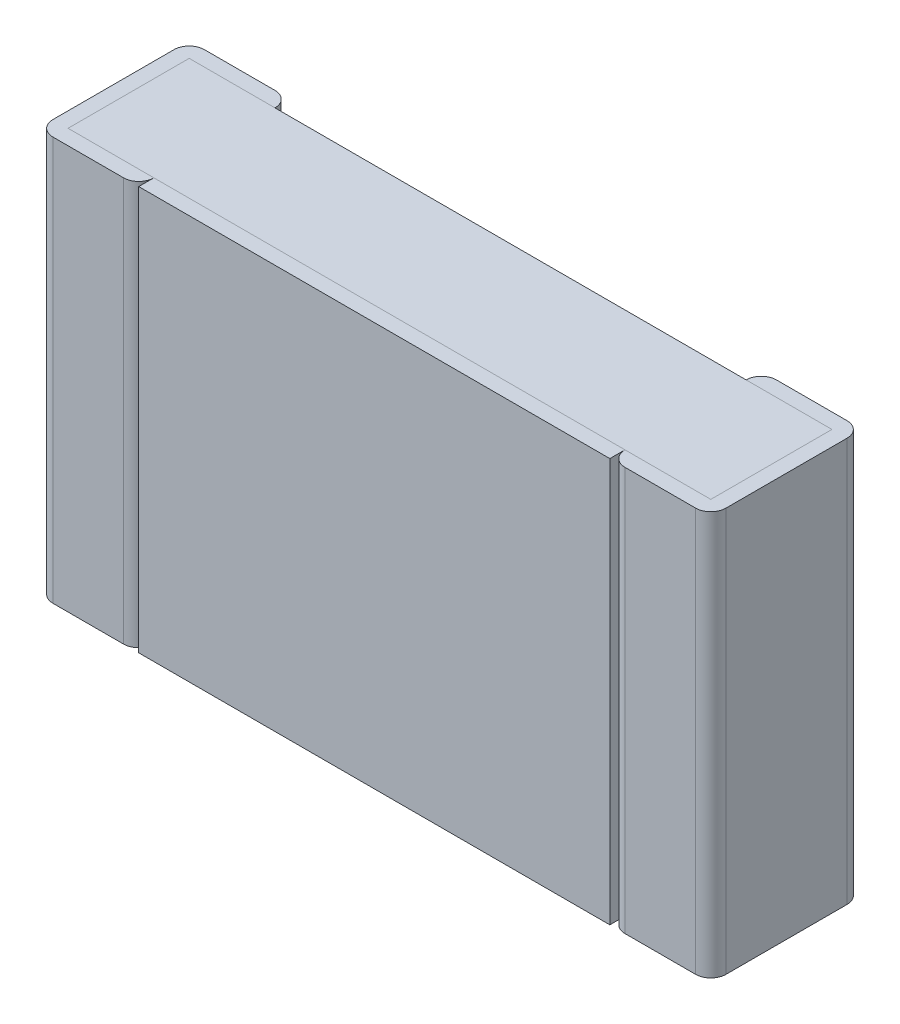
ISO-10303-21;
HEADER;
FILE_DESCRIPTION(('STEP AP214'),'2;1');
FILE_NAME('part.step','',(''),(''),'','','');
FILE_SCHEMA(('AUTOMOTIVE_DESIGN { 1 0 10303 214 1 1 1 1 }'));
ENDSEC;
DATA;
#1=APPLICATION_CONTEXT('core data for automotive mechanical design processes');
#2=APPLICATION_PROTOCOL_DEFINITION('international standard','automotive_design',2000,#1);
#3=PRODUCT_CONTEXT('',#1,'mechanical');
#4=PRODUCT('Part','Part','',(#3));
#5=PRODUCT_RELATED_PRODUCT_CATEGORY('part','',(#4));
#6=PRODUCT_DEFINITION_FORMATION('','',#4);
#7=PRODUCT_DEFINITION_CONTEXT('part definition',#1,'design');
#8=PRODUCT_DEFINITION('design','',#6,#7);
#9=PRODUCT_DEFINITION_SHAPE('','',#8);
#10=(LENGTH_UNIT() NAMED_UNIT(*) SI_UNIT(.MILLI.,.METRE.));
#11=(NAMED_UNIT(*) PLANE_ANGLE_UNIT() SI_UNIT($,.RADIAN.));
#12=(NAMED_UNIT(*) SI_UNIT($,.STERADIAN.) SOLID_ANGLE_UNIT());
#13=UNCERTAINTY_MEASURE_WITH_UNIT(LENGTH_MEASURE(1.E-05),#10,'distance_accuracy_value','');
#14=(GEOMETRIC_REPRESENTATION_CONTEXT(3) GLOBAL_UNCERTAINTY_ASSIGNED_CONTEXT((#13)) GLOBAL_UNIT_ASSIGNED_CONTEXT((#10,
#11,#12)) REPRESENTATION_CONTEXT('',''));
#15=CARTESIAN_POINT('',(0.,0.,0.));
#16=DIRECTION('',(0.,0.,1.));
#17=DIRECTION('',(1.,0.,0.));
#18=AXIS2_PLACEMENT_3D('',#15,#16,#17);
#19=CARTESIAN_POINT('',(-1.,-0.6,0.));
#20=DIRECTION('',(1.,0.,0.));
#21=DIRECTION('',(0.,1.,0.));
#22=AXIS2_PLACEMENT_3D('',#19,#20,#21);
#23=PLANE('',#22);
#24=DIRECTION('',(0.,1.,0.));
#25=VECTOR('',#24,1.);
#26=CARTESIAN_POINT('',(-1.,-0.6,0.405));
#27=LINE('',#26,#25);
#28=CARTESIAN_POINT('',(-1.,-0.6,0.405));
#29=VERTEX_POINT('',#28);
#30=CARTESIAN_POINT('',(-1.,0.6,0.405));
#31=VERTEX_POINT('',#30);
#32=EDGE_CURVE('E11',#29,#31,#27,.T.);
#33=ORIENTED_EDGE('',*,*,#32,.T.);
#34=DIRECTION('',(0.,0.,1.));
#35=VECTOR('',#34,1.);
#36=CARTESIAN_POINT('',(-1.,0.6,0.));
#37=LINE('',#36,#35);
#38=CARTESIAN_POINT('',(-1.,0.6,0.045));
#39=VERTEX_POINT('',#38);
#40=EDGE_CURVE('E41',#39,#31,#37,.T.);
#41=ORIENTED_EDGE('',*,*,#40,.F.);
#42=DIRECTION('',(0.,1.,0.));
#43=VECTOR('',#42,1.);
#44=CARTESIAN_POINT('',(-1.,-0.6,0.045));
#45=LINE('',#44,#43);
#46=CARTESIAN_POINT('',(-1.,-0.6,0.045));
#47=VERTEX_POINT('',#46);
#48=EDGE_CURVE('E398',#47,#39,#45,.T.);
#49=ORIENTED_EDGE('',*,*,#48,.F.);
#50=DIRECTION('',(0.,0.,1.));
#51=VECTOR('',#50,1.);
#52=CARTESIAN_POINT('',(-1.,-0.6,0.));
#53=LINE('',#52,#51);
#54=EDGE_CURVE('E27',#47,#29,#53,.T.);
#55=ORIENTED_EDGE('',*,*,#54,.T.);
#56=EDGE_LOOP('',(#33,#41,#49,#55));
#57=FACE_BOUND('',#56,.T.);
#58=ADVANCED_FACE('F16',(#57),#23,.F.);
#59=CARTESIAN_POINT('',(-1.,-0.6,0.));
#60=DIRECTION('',(0.,1.,0.));
#61=DIRECTION('',(1.,0.,0.));
#62=AXIS2_PLACEMENT_3D('',#59,#60,#61);
#63=PLANE('',#62);
#64=CARTESIAN_POINT('',(-0.745,-0.6,0.045));
#65=DIRECTION('',(0.,1.,0.));
#66=DIRECTION('',(0.,0.,1.));
#67=AXIS2_PLACEMENT_3D('',#64,#65,#66);
#68=CIRCLE('',#67,0.045);
#69=CARTESIAN_POINT('',(-0.7,-0.6,0.045));
#70=VERTEX_POINT('',#69);
#71=CARTESIAN_POINT('',(-0.745,-0.6,0.));
#72=VERTEX_POINT('',#71);
#73=EDGE_CURVE('E387',#70,#72,#68,.T.);
#74=ORIENTED_EDGE('',*,*,#73,.F.);
#75=DIRECTION('',(1.,0.,0.));
#76=VECTOR('',#75,1.);
#77=CARTESIAN_POINT('',(-0.955,-0.6,0.045));
#78=LINE('',#77,#76);
#79=CARTESIAN_POINT('',(-0.955,-0.6,0.045));
#80=VERTEX_POINT('',#79);
#81=EDGE_CURVE('E428',#80,#70,#78,.T.);
#82=ORIENTED_EDGE('',*,*,#81,.F.);
#83=DIRECTION('',(0.,0.,1.));
#84=VECTOR('',#83,1.);
#85=CARTESIAN_POINT('',(-0.955,-0.6,0.045));
#86=LINE('',#85,#84);
#87=CARTESIAN_POINT('',(-0.955,-0.6,0.405));
#88=VERTEX_POINT('',#87);
#89=EDGE_CURVE('E230',#80,#88,#86,.T.);
#90=ORIENTED_EDGE('',*,*,#89,.T.);
#91=DIRECTION('',(1.,0.,0.));
#92=VECTOR('',#91,1.);
#93=CARTESIAN_POINT('',(-0.955,-0.6,0.405));
#94=LINE('',#93,#92);
#95=CARTESIAN_POINT('',(-0.7,-0.6,0.405));
#96=VERTEX_POINT('',#95);
#97=EDGE_CURVE('E241',#88,#96,#94,.T.);
#98=ORIENTED_EDGE('',*,*,#97,.T.);
#99=CARTESIAN_POINT('',(-0.745,-0.6,0.405));
#100=DIRECTION('',(0.,-1.,0.));
#101=DIRECTION('',(0.,0.,1.));
#102=AXIS2_PLACEMENT_3D('',#99,#100,#101);
#103=CIRCLE('',#102,0.045);
#104=CARTESIAN_POINT('',(-0.745,-0.6,0.45));
#105=VERTEX_POINT('',#104);
#106=EDGE_CURVE('E270',#96,#105,#103,.T.);
#107=ORIENTED_EDGE('',*,*,#106,.T.);
#108=DIRECTION('',(1.,0.,0.));
#109=VECTOR('',#108,1.);
#110=CARTESIAN_POINT('',(-1.,-0.6,0.45));
#111=LINE('',#110,#109);
#112=CARTESIAN_POINT('',(-0.955,-0.6,0.45));
#113=VERTEX_POINT('',#112);
#114=EDGE_CURVE('E425',#113,#105,#111,.T.);
#115=ORIENTED_EDGE('',*,*,#114,.F.);
#116=CARTESIAN_POINT('',(-0.955,-0.6,0.405));
#117=DIRECTION('',(0.,1.,0.));
#118=DIRECTION('',(0.,0.,1.));
#119=AXIS2_PLACEMENT_3D('',#116,#117,#118);
#120=CIRCLE('',#119,0.045);
#121=EDGE_CURVE('E405',#29,#113,#120,.T.);
#122=ORIENTED_EDGE('',*,*,#121,.F.);
#123=ORIENTED_EDGE('',*,*,#54,.F.);
#124=CARTESIAN_POINT('',(-0.955,-0.6,0.045));
#125=DIRECTION('',(0.,-1.,0.));
#126=DIRECTION('',(0.,0.,1.));
#127=AXIS2_PLACEMENT_3D('',#124,#125,#126);
#128=CIRCLE('',#127,0.045);
#129=CARTESIAN_POINT('',(-0.955,-0.6,0.));
#130=VERTEX_POINT('',#129);
#131=EDGE_CURVE('E274',#47,#130,#128,.T.);
#132=ORIENTED_EDGE('',*,*,#131,.T.);
#133=DIRECTION('',(1.,0.,0.));
#134=VECTOR('',#133,1.);
#135=CARTESIAN_POINT('',(-1.,-0.6,0.));
#136=LINE('',#135,#134);
#137=EDGE_CURVE('E332',#130,#72,#136,.T.);
#138=ORIENTED_EDGE('',*,*,#137,.T.);
#139=EDGE_LOOP('',(#74,#82,#90,#98,#107,#115,#122,#123,#132,#138));
#140=FACE_BOUND('',#139,.T.);
#141=ADVANCED_FACE('F277',(#140),#63,.F.);
#142=CARTESIAN_POINT('',(-0.955,-0.6,0.045));
#143=DIRECTION('',(0.,1.,0.));
#144=DIRECTION('',(-1.,0.,0.));
#145=AXIS2_PLACEMENT_3D('',#142,#143,#144);
#146=CYLINDRICAL_SURFACE('',#145,0.045);
#147=ORIENTED_EDGE('',*,*,#48,.T.);
#148=CARTESIAN_POINT('',(-0.955,0.6,0.045));
#149=DIRECTION('',(0.,-1.,0.));
#150=DIRECTION('',(0.,0.,1.));
#151=AXIS2_PLACEMENT_3D('',#148,#149,#150);
#152=CIRCLE('',#151,0.045);
#153=CARTESIAN_POINT('',(-0.955,0.6,0.));
#154=VERTEX_POINT('',#153);
#155=EDGE_CURVE('E401',#39,#154,#152,.T.);
#156=ORIENTED_EDGE('',*,*,#155,.T.);
#157=DIRECTION('',(0.,1.,0.));
#158=VECTOR('',#157,1.);
#159=CARTESIAN_POINT('',(-0.955,-0.6,0.));
#160=LINE('',#159,#158);
#161=EDGE_CURVE('E303',#130,#154,#160,.T.);
#162=ORIENTED_EDGE('',*,*,#161,.F.);
#163=ORIENTED_EDGE('',*,*,#131,.F.);
#164=EDGE_LOOP('',(#147,#156,#162,#163));
#165=FACE_BOUND('',#164,.T.);
#166=ADVANCED_FACE('F707',(#165),#146,.T.);
#167=CARTESIAN_POINT('',(-0.955,-0.6,0.405));
#168=DIRECTION('',(0.,1.,0.));
#169=DIRECTION('',(-1.,0.,0.));
#170=AXIS2_PLACEMENT_3D('',#167,#168,#169);
#171=CYLINDRICAL_SURFACE('',#170,0.045);
#172=ORIENTED_EDGE('',*,*,#121,.T.);
#173=DIRECTION('',(0.,1.,0.));
#174=VECTOR('',#173,1.);
#175=CARTESIAN_POINT('',(-0.955,-0.6,0.45));
#176=LINE('',#175,#174);
#177=CARTESIAN_POINT('',(-0.955,0.6,0.45));
#178=VERTEX_POINT('',#177);
#179=EDGE_CURVE('E402',#113,#178,#176,.T.);
#180=ORIENTED_EDGE('',*,*,#179,.T.);
#181=CARTESIAN_POINT('',(-0.955,0.6,0.405));
#182=DIRECTION('',(0.,1.,0.));
#183=DIRECTION('',(0.,0.,1.));
#184=AXIS2_PLACEMENT_3D('',#181,#182,#183);
#185=CIRCLE('',#184,0.045);
#186=EDGE_CURVE('E328',#31,#178,#185,.T.);
#187=ORIENTED_EDGE('',*,*,#186,.F.);
#188=ORIENTED_EDGE('',*,*,#32,.F.);
#189=EDGE_LOOP('',(#172,#180,#187,#188));
#190=FACE_BOUND('',#189,.T.);
#191=ADVANCED_FACE('F697',(#190),#171,.T.);
#192=CARTESIAN_POINT('',(-1.,0.6,0.));
#193=DIRECTION('',(0.,1.,0.));
#194=DIRECTION('',(1.,0.,0.));
#195=AXIS2_PLACEMENT_3D('',#192,#193,#194);
#196=PLANE('',#195);
#197=DIRECTION('',(1.,0.,0.));
#198=VECTOR('',#197,1.);
#199=CARTESIAN_POINT('',(-1.,0.6,0.));
#200=LINE('',#199,#198);
#201=CARTESIAN_POINT('',(-0.745,0.6,0.));
#202=VERTEX_POINT('',#201);
#203=EDGE_CURVE('E384',#154,#202,#200,.T.);
#204=ORIENTED_EDGE('',*,*,#203,.F.);
#205=ORIENTED_EDGE('',*,*,#155,.F.);
#206=ORIENTED_EDGE('',*,*,#40,.T.);
#207=ORIENTED_EDGE('',*,*,#186,.T.);
#208=DIRECTION('',(1.,0.,0.));
#209=VECTOR('',#208,1.);
#210=CARTESIAN_POINT('',(-1.,0.6,0.45));
#211=LINE('',#210,#209);
#212=CARTESIAN_POINT('',(-0.745,0.6,0.45));
#213=VERTEX_POINT('',#212);
#214=EDGE_CURVE('E391',#178,#213,#211,.T.);
#215=ORIENTED_EDGE('',*,*,#214,.T.);
#216=CARTESIAN_POINT('',(-0.745,0.6,0.405));
#217=DIRECTION('',(0.,-1.,0.));
#218=DIRECTION('',(0.,0.,1.));
#219=AXIS2_PLACEMENT_3D('',#216,#217,#218);
#220=CIRCLE('',#219,0.045);
#221=CARTESIAN_POINT('',(-0.7,0.6,0.405));
#222=VERTEX_POINT('',#221);
#223=EDGE_CURVE('E266',#222,#213,#220,.T.);
#224=ORIENTED_EDGE('',*,*,#223,.F.);
#225=DIRECTION('',(1.,0.,0.));
#226=VECTOR('',#225,1.);
#227=CARTESIAN_POINT('',(-0.955,0.6,0.405));
#228=LINE('',#227,#226);
#229=CARTESIAN_POINT('',(-0.955,0.6,0.405));
#230=VERTEX_POINT('',#229);
#231=EDGE_CURVE('E351',#230,#222,#228,.T.);
#232=ORIENTED_EDGE('',*,*,#231,.F.);
#233=DIRECTION('',(0.,0.,1.));
#234=VECTOR('',#233,1.);
#235=CARTESIAN_POINT('',(-0.955,0.6,0.045));
#236=LINE('',#235,#234);
#237=CARTESIAN_POINT('',(-0.955,0.6,0.045));
#238=VERTEX_POINT('',#237);
#239=EDGE_CURVE('E347',#238,#230,#236,.T.);
#240=ORIENTED_EDGE('',*,*,#239,.F.);
#241=DIRECTION('',(1.,0.,0.));
#242=VECTOR('',#241,1.);
#243=CARTESIAN_POINT('',(-0.955,0.6,0.045));
#244=LINE('',#243,#242);
#245=CARTESIAN_POINT('',(-0.7,0.6,0.045));
#246=VERTEX_POINT('',#245);
#247=EDGE_CURVE('E302',#238,#246,#244,.T.);
#248=ORIENTED_EDGE('',*,*,#247,.T.);
#249=CARTESIAN_POINT('',(-0.745,0.6,0.045));
#250=DIRECTION('',(0.,1.,0.));
#251=DIRECTION('',(0.,0.,1.));
#252=AXIS2_PLACEMENT_3D('',#249,#250,#251);
#253=CIRCLE('',#252,0.045);
#254=EDGE_CURVE('E299',#246,#202,#253,.T.);
#255=ORIENTED_EDGE('',*,*,#254,.T.);
#256=EDGE_LOOP('',(#204,#205,#206,#207,#215,#224,#232,#240,#248,#255));
#257=FACE_BOUND('',#256,.T.);
#258=ADVANCED_FACE('F684',(#257),#196,.T.);
#259=CARTESIAN_POINT('',(-1.,-0.6,0.));
#260=DIRECTION('',(0.,0.,1.));
#261=DIRECTION('',(1.,0.,0.));
#262=AXIS2_PLACEMENT_3D('',#259,#260,#261);
#263=PLANE('',#262);
#264=DIRECTION('',(0.,1.,0.));
#265=VECTOR('',#264,1.);
#266=CARTESIAN_POINT('',(-0.745,-0.6,0.));
#267=LINE('',#266,#265);
#268=EDGE_CURVE('E390',#72,#202,#267,.T.);
#269=ORIENTED_EDGE('',*,*,#268,.F.);
#270=ORIENTED_EDGE('',*,*,#137,.F.);
#271=ORIENTED_EDGE('',*,*,#161,.T.);
#272=ORIENTED_EDGE('',*,*,#203,.T.);
#273=EDGE_LOOP('',(#269,#270,#271,#272));
#274=FACE_BOUND('',#273,.T.);
#275=ADVANCED_FACE('F671',(#274),#263,.F.);
#276=CARTESIAN_POINT('',(-0.745,-0.6,0.045));
#277=DIRECTION('',(0.,1.,0.));
#278=DIRECTION('',(1.,0.,0.));
#279=AXIS2_PLACEMENT_3D('',#276,#277,#278);
#280=CYLINDRICAL_SURFACE('',#279,0.045);
#281=ORIENTED_EDGE('',*,*,#73,.T.);
#282=ORIENTED_EDGE('',*,*,#268,.T.);
#283=ORIENTED_EDGE('',*,*,#254,.F.);
#284=DIRECTION('',(0.,1.,0.));
#285=VECTOR('',#284,1.);
#286=CARTESIAN_POINT('',(-0.7,-0.6,0.045));
#287=LINE('',#286,#285);
#288=EDGE_CURVE('E451',#70,#246,#287,.T.);
#289=ORIENTED_EDGE('',*,*,#288,.F.);
#290=EDGE_LOOP('',(#281,#282,#283,#289));
#291=FACE_BOUND('',#290,.T.);
#292=ADVANCED_FACE('F572',(#291),#280,.T.);
#293=CARTESIAN_POINT('',(-0.955,-0.6,0.045));
#294=DIRECTION('',(0.,1.,0.));
#295=DIRECTION('',(1.,0.,0.));
#296=AXIS2_PLACEMENT_3D('',#293,#294,#295);
#297=PLANE('',#296);
#298=DIRECTION('',(1.,0.,0.));
#299=VECTOR('',#298,1.);
#300=CARTESIAN_POINT('',(-0.955,-0.6,0.045));
#301=LINE('',#300,#299);
#302=CARTESIAN_POINT('',(0.7,-0.6,0.045));
#303=VERTEX_POINT('',#302);
#304=EDGE_CURVE('E375',#70,#303,#301,.T.);
#305=ORIENTED_EDGE('',*,*,#304,.T.);
#306=DIRECTION('',(1.,0.,0.));
#307=VECTOR('',#306,1.);
#308=CARTESIAN_POINT('',(-0.955,-0.6,0.045));
#309=LINE('',#308,#307);
#310=CARTESIAN_POINT('',(0.955,-0.6,0.045));
#311=VERTEX_POINT('',#310);
#312=EDGE_CURVE('E371',#303,#311,#309,.T.);
#313=ORIENTED_EDGE('',*,*,#312,.T.);
#314=DIRECTION('',(0.,0.,1.));
#315=VECTOR('',#314,1.);
#316=CARTESIAN_POINT('',(0.955,-0.6,0.045));
#317=LINE('',#316,#315);
#318=CARTESIAN_POINT('',(0.955,-0.6,0.405));
#319=VERTEX_POINT('',#318);
#320=EDGE_CURVE('E376',#311,#319,#317,.T.);
#321=ORIENTED_EDGE('',*,*,#320,.T.);
#322=DIRECTION('',(1.,0.,0.));
#323=VECTOR('',#322,1.);
#324=CARTESIAN_POINT('',(-0.955,-0.6,0.405));
#325=LINE('',#324,#323);
#326=CARTESIAN_POINT('',(0.7,-0.6,0.405));
#327=VERTEX_POINT('',#326);
#328=EDGE_CURVE('E243',#327,#319,#325,.T.);
#329=ORIENTED_EDGE('',*,*,#328,.F.);
#330=DIRECTION('',(1.,0.,0.));
#331=VECTOR('',#330,1.);
#332=CARTESIAN_POINT('',(-0.7,-0.6,0.405));
#333=LINE('',#332,#331);
#334=EDGE_CURVE('E237',#96,#327,#333,.T.);
#335=ORIENTED_EDGE('',*,*,#334,.F.);
#336=ORIENTED_EDGE('',*,*,#97,.F.);
#337=ORIENTED_EDGE('',*,*,#89,.F.);
#338=ORIENTED_EDGE('',*,*,#81,.T.);
#339=EDGE_LOOP('',(#305,#313,#321,#329,#335,#336,#337,#338));
#340=FACE_BOUND('',#339,.T.);
#341=ADVANCED_FACE('F240',(#340),#297,.F.);
#342=CARTESIAN_POINT('',(-1.,-0.6,0.45));
#343=DIRECTION('',(0.,0.,1.));
#344=DIRECTION('',(1.,0.,0.));
#345=AXIS2_PLACEMENT_3D('',#342,#343,#344);
#346=PLANE('',#345);
#347=ORIENTED_EDGE('',*,*,#214,.F.);
#348=ORIENTED_EDGE('',*,*,#179,.F.);
#349=ORIENTED_EDGE('',*,*,#114,.T.);
#350=DIRECTION('',(0.,1.,0.));
#351=VECTOR('',#350,1.);
#352=CARTESIAN_POINT('',(-0.745,-0.6,0.45));
#353=LINE('',#352,#351);
#354=EDGE_CURVE('E265',#105,#213,#353,.T.);
#355=ORIENTED_EDGE('',*,*,#354,.T.);
#356=EDGE_LOOP('',(#347,#348,#349,#355));
#357=FACE_BOUND('',#356,.T.);
#358=ADVANCED_FACE('F571',(#357),#346,.T.);
#359=CARTESIAN_POINT('',(-0.745,-0.6,0.405));
#360=DIRECTION('',(0.,1.,0.));
#361=DIRECTION('',(1.,0.,0.));
#362=AXIS2_PLACEMENT_3D('',#359,#360,#361);
#363=CYLINDRICAL_SURFACE('',#362,0.045);
#364=DIRECTION('',(0.,1.,0.));
#365=VECTOR('',#364,1.);
#366=CARTESIAN_POINT('',(-0.7,-0.6,0.405));
#367=LINE('',#366,#365);
#368=EDGE_CURVE('E256',#96,#222,#367,.T.);
#369=ORIENTED_EDGE('',*,*,#368,.T.);
#370=ORIENTED_EDGE('',*,*,#223,.T.);
#371=ORIENTED_EDGE('',*,*,#354,.F.);
#372=ORIENTED_EDGE('',*,*,#106,.F.);
#373=EDGE_LOOP('',(#369,#370,#371,#372));
#374=FACE_BOUND('',#373,.T.);
#375=ADVANCED_FACE('F271',(#374),#363,.T.);
#376=CARTESIAN_POINT('',(-0.955,0.6,0.045));
#377=DIRECTION('',(0.,1.,0.));
#378=DIRECTION('',(1.,0.,0.));
#379=AXIS2_PLACEMENT_3D('',#376,#377,#378);
#380=PLANE('',#379);
#381=ORIENTED_EDGE('',*,*,#247,.F.);
#382=ORIENTED_EDGE('',*,*,#239,.T.);
#383=ORIENTED_EDGE('',*,*,#231,.T.);
#384=DIRECTION('',(1.,0.,0.));
#385=VECTOR('',#384,1.);
#386=CARTESIAN_POINT('',(-0.7,0.6,0.405));
#387=LINE('',#386,#385);
#388=CARTESIAN_POINT('',(0.7,0.6,0.405));
#389=VERTEX_POINT('',#388);
#390=EDGE_CURVE('E336',#222,#389,#387,.T.);
#391=ORIENTED_EDGE('',*,*,#390,.T.);
#392=DIRECTION('',(1.,0.,0.));
#393=VECTOR('',#392,1.);
#394=CARTESIAN_POINT('',(-0.955,0.6,0.405));
#395=LINE('',#394,#393);
#396=CARTESIAN_POINT('',(0.955,0.6,0.405));
#397=VERTEX_POINT('',#396);
#398=EDGE_CURVE('E333',#389,#397,#395,.T.);
#399=ORIENTED_EDGE('',*,*,#398,.T.);
#400=DIRECTION('',(0.,0.,1.));
#401=VECTOR('',#400,1.);
#402=CARTESIAN_POINT('',(0.955,0.6,0.045));
#403=LINE('',#402,#401);
#404=CARTESIAN_POINT('',(0.955,0.6,0.045));
#405=VERTEX_POINT('',#404);
#406=EDGE_CURVE('E291',#405,#397,#403,.T.);
#407=ORIENTED_EDGE('',*,*,#406,.F.);
#408=DIRECTION('',(1.,0.,0.));
#409=VECTOR('',#408,1.);
#410=CARTESIAN_POINT('',(-0.955,0.6,0.045));
#411=LINE('',#410,#409);
#412=CARTESIAN_POINT('',(0.7,0.6,0.045));
#413=VERTEX_POINT('',#412);
#414=EDGE_CURVE('E283',#413,#405,#411,.T.);
#415=ORIENTED_EDGE('',*,*,#414,.F.);
#416=DIRECTION('',(1.,0.,0.));
#417=VECTOR('',#416,1.);
#418=CARTESIAN_POINT('',(-0.955,0.6,0.045));
#419=LINE('',#418,#417);
#420=EDGE_CURVE('E337',#246,#413,#419,.T.);
#421=ORIENTED_EDGE('',*,*,#420,.F.);
#422=EDGE_LOOP('',(#381,#382,#383,#391,#399,#407,#415,#421));
#423=FACE_BOUND('',#422,.T.);
#424=ADVANCED_FACE('F505',(#423),#380,.T.);
#425=CARTESIAN_POINT('',(-0.955,-0.6,0.045));
#426=DIRECTION('',(0.,0.,1.));
#427=DIRECTION('',(1.,0.,0.));
#428=AXIS2_PLACEMENT_3D('',#425,#426,#427);
#429=PLANE('',#428);
#430=ORIENTED_EDGE('',*,*,#420,.T.);
#431=DIRECTION('',(0.,1.,0.));
#432=VECTOR('',#431,1.);
#433=CARTESIAN_POINT('',(0.7,-0.6,0.045));
#434=LINE('',#433,#432);
#435=EDGE_CURVE('E343',#303,#413,#434,.T.);
#436=ORIENTED_EDGE('',*,*,#435,.F.);
#437=ORIENTED_EDGE('',*,*,#304,.F.);
#438=ORIENTED_EDGE('',*,*,#288,.T.);
#439=EDGE_LOOP('',(#430,#436,#437,#438));
#440=FACE_BOUND('',#439,.T.);
#441=ADVANCED_FACE('F560',(#440),#429,.F.);
#442=CARTESIAN_POINT('',(0.7,-0.6,0.));
#443=DIRECTION('',(0.,1.,0.));
#444=DIRECTION('',(1.,0.,0.));
#445=AXIS2_PLACEMENT_3D('',#442,#443,#444);
#446=PLANE('',#445);
#447=CARTESIAN_POINT('',(0.955,-0.6,0.045));
#448=DIRECTION('',(0.,1.,0.));
#449=DIRECTION('',(0.,0.,1.));
#450=AXIS2_PLACEMENT_3D('',#447,#448,#449);
#451=CIRCLE('',#450,0.045);
#452=CARTESIAN_POINT('',(1.,-0.6,0.045));
#453=VERTEX_POINT('',#452);
#454=CARTESIAN_POINT('',(0.955,-0.6,0.));
#455=VERTEX_POINT('',#454);
#456=EDGE_CURVE('E307',#453,#455,#451,.T.);
#457=ORIENTED_EDGE('',*,*,#456,.F.);
#458=DIRECTION('',(0.,0.,1.));
#459=VECTOR('',#458,1.);
#460=CARTESIAN_POINT('',(1.,-0.6,0.));
#461=LINE('',#460,#459);
#462=CARTESIAN_POINT('',(1.,-0.6,0.405));
#463=VERTEX_POINT('',#462);
#464=EDGE_CURVE('E443',#453,#463,#461,.T.);
#465=ORIENTED_EDGE('',*,*,#464,.T.);
#466=CARTESIAN_POINT('',(0.955,-0.6,0.405));
#467=DIRECTION('',(0.,-1.,0.));
#468=DIRECTION('',(0.,0.,1.));
#469=AXIS2_PLACEMENT_3D('',#466,#467,#468);
#470=CIRCLE('',#469,0.045);
#471=CARTESIAN_POINT('',(0.955,-0.6,0.45));
#472=VERTEX_POINT('',#471);
#473=EDGE_CURVE('E440',#463,#472,#470,.T.);
#474=ORIENTED_EDGE('',*,*,#473,.T.);
#475=DIRECTION('',(1.,0.,0.));
#476=VECTOR('',#475,1.);
#477=CARTESIAN_POINT('',(0.7,-0.6,0.45));
#478=LINE('',#477,#476);
#479=CARTESIAN_POINT('',(0.745,-0.6,0.45));
#480=VERTEX_POINT('',#479);
#481=EDGE_CURVE('E344',#480,#472,#478,.T.);
#482=ORIENTED_EDGE('',*,*,#481,.F.);
#483=CARTESIAN_POINT('',(0.745,-0.6,0.405));
#484=DIRECTION('',(0.,1.,0.));
#485=DIRECTION('',(0.,0.,1.));
#486=AXIS2_PLACEMENT_3D('',#483,#484,#485);
#487=CIRCLE('',#486,0.045);
#488=EDGE_CURVE('E189',#327,#480,#487,.T.);
#489=ORIENTED_EDGE('',*,*,#488,.F.);
#490=ORIENTED_EDGE('',*,*,#328,.T.);
#491=ORIENTED_EDGE('',*,*,#320,.F.);
#492=ORIENTED_EDGE('',*,*,#312,.F.);
#493=CARTESIAN_POINT('',(0.745,-0.6,0.045));
#494=DIRECTION('',(0.,-1.,0.));
#495=DIRECTION('',(0.,0.,1.));
#496=AXIS2_PLACEMENT_3D('',#493,#494,#495);
#497=CIRCLE('',#496,0.045);
#498=CARTESIAN_POINT('',(0.745,-0.6,0.));
#499=VERTEX_POINT('',#498);
#500=EDGE_CURVE('E359',#303,#499,#497,.T.);
#501=ORIENTED_EDGE('',*,*,#500,.T.);
#502=DIRECTION('',(1.,0.,0.));
#503=VECTOR('',#502,1.);
#504=CARTESIAN_POINT('',(0.7,-0.6,0.));
#505=LINE('',#504,#503);
#506=EDGE_CURVE('E180',#499,#455,#505,.T.);
#507=ORIENTED_EDGE('',*,*,#506,.T.);
#508=EDGE_LOOP('',(#457,#465,#474,#482,#489,#490,#491,#492,#501,#507));
#509=FACE_BOUND('',#508,.T.);
#510=ADVANCED_FACE('F592',(#509),#446,.F.);
#511=CARTESIAN_POINT('',(-0.7,-0.6,0.405));
#512=DIRECTION('',(0.,1.,0.));
#513=DIRECTION('',(1.,0.,0.));
#514=AXIS2_PLACEMENT_3D('',#511,#512,#513);
#515=PLANE('',#514);
#516=DIRECTION('',(0.,0.,1.));
#517=VECTOR('',#516,1.);
#518=CARTESIAN_POINT('',(0.7,-0.6,0.405));
#519=LINE('',#518,#517);
#520=CARTESIAN_POINT('',(0.7,-0.6,0.45));
#521=VERTEX_POINT('',#520);
#522=EDGE_CURVE('E249',#327,#521,#519,.T.);
#523=ORIENTED_EDGE('',*,*,#522,.T.);
#524=DIRECTION('',(1.,0.,0.));
#525=VECTOR('',#524,1.);
#526=CARTESIAN_POINT('',(-0.7,-0.6,0.45));
#527=LINE('',#526,#525);
#528=CARTESIAN_POINT('',(-0.7,-0.6,0.45));
#529=VERTEX_POINT('',#528);
#530=EDGE_CURVE('E281',#529,#521,#527,.T.);
#531=ORIENTED_EDGE('',*,*,#530,.F.);
#532=DIRECTION('',(0.,0.,1.));
#533=VECTOR('',#532,1.);
#534=CARTESIAN_POINT('',(-0.7,-0.6,0.405));
#535=LINE('',#534,#533);
#536=EDGE_CURVE('E260',#96,#529,#535,.T.);
#537=ORIENTED_EDGE('',*,*,#536,.F.);
#538=ORIENTED_EDGE('',*,*,#334,.T.);
#539=EDGE_LOOP('',(#523,#531,#537,#538));
#540=FACE_BOUND('',#539,.T.);
#541=ADVANCED_FACE('F280',(#540),#515,.F.);
#542=CARTESIAN_POINT('',(-0.7,-0.6,0.405));
#543=DIRECTION('',(1.,0.,0.));
#544=DIRECTION('',(0.,1.,0.));
#545=AXIS2_PLACEMENT_3D('',#542,#543,#544);
#546=PLANE('',#545);
#547=DIRECTION('',(0.,1.,0.));
#548=VECTOR('',#547,1.);
#549=CARTESIAN_POINT('',(-0.7,-0.6,0.45));
#550=LINE('',#549,#548);
#551=CARTESIAN_POINT('',(-0.7,0.6,0.45));
#552=VERTEX_POINT('',#551);
#553=EDGE_CURVE('E250',#529,#552,#550,.T.);
#554=ORIENTED_EDGE('',*,*,#553,.T.);
#555=DIRECTION('',(0.,0.,1.));
#556=VECTOR('',#555,1.);
#557=CARTESIAN_POINT('',(-0.7,0.6,0.405));
#558=LINE('',#557,#556);
#559=EDGE_CURVE('E262',#222,#552,#558,.T.);
#560=ORIENTED_EDGE('',*,*,#559,.F.);
#561=ORIENTED_EDGE('',*,*,#368,.F.);
#562=ORIENTED_EDGE('',*,*,#536,.T.);
#563=EDGE_LOOP('',(#554,#560,#561,#562));
#564=FACE_BOUND('',#563,.T.);
#565=ADVANCED_FACE('F259',(#564),#546,.F.);
#566=CARTESIAN_POINT('',(0.7,0.6,0.));
#567=DIRECTION('',(0.,1.,0.));
#568=DIRECTION('',(1.,0.,0.));
#569=AXIS2_PLACEMENT_3D('',#566,#567,#568);
#570=PLANE('',#569);
#571=DIRECTION('',(1.,0.,0.));
#572=VECTOR('',#571,1.);
#573=CARTESIAN_POINT('',(0.7,0.6,0.));
#574=LINE('',#573,#572);
#575=CARTESIAN_POINT('',(0.745,0.6,0.));
#576=VERTEX_POINT('',#575);
#577=CARTESIAN_POINT('',(0.955,0.6,0.));
#578=VERTEX_POINT('',#577);
#579=EDGE_CURVE('E298',#576,#578,#574,.T.);
#580=ORIENTED_EDGE('',*,*,#579,.F.);
#581=CARTESIAN_POINT('',(0.745,0.6,0.045));
#582=DIRECTION('',(0.,-1.,0.));
#583=DIRECTION('',(0.,0.,1.));
#584=AXIS2_PLACEMENT_3D('',#581,#582,#583);
#585=CIRCLE('',#584,0.045);
#586=EDGE_CURVE('E297',#413,#576,#585,.T.);
#587=ORIENTED_EDGE('',*,*,#586,.F.);
#588=ORIENTED_EDGE('',*,*,#414,.T.);
#589=ORIENTED_EDGE('',*,*,#406,.T.);
#590=ORIENTED_EDGE('',*,*,#398,.F.);
#591=CARTESIAN_POINT('',(0.745,0.6,0.405));
#592=DIRECTION('',(0.,1.,0.));
#593=DIRECTION('',(0.,0.,1.));
#594=AXIS2_PLACEMENT_3D('',#591,#592,#593);
#595=CIRCLE('',#594,0.045);
#596=CARTESIAN_POINT('',(0.745,0.6,0.45));
#597=VERTEX_POINT('',#596);
#598=EDGE_CURVE('E380',#389,#597,#595,.T.);
#599=ORIENTED_EDGE('',*,*,#598,.T.);
#600=DIRECTION('',(1.,0.,0.));
#601=VECTOR('',#600,1.);
#602=CARTESIAN_POINT('',(0.7,0.6,0.45));
#603=LINE('',#602,#601);
#604=CARTESIAN_POINT('',(0.955,0.6,0.45));
#605=VERTEX_POINT('',#604);
#606=EDGE_CURVE('E368',#597,#605,#603,.T.);
#607=ORIENTED_EDGE('',*,*,#606,.T.);
#608=CARTESIAN_POINT('',(0.955,0.6,0.405));
#609=DIRECTION('',(0.,-1.,0.));
#610=DIRECTION('',(0.,0.,1.));
#611=AXIS2_PLACEMENT_3D('',#608,#609,#610);
#612=CIRCLE('',#611,0.045);
#613=CARTESIAN_POINT('',(1.,0.6,0.405));
#614=VERTEX_POINT('',#613);
#615=EDGE_CURVE('E118',#614,#605,#612,.T.);
#616=ORIENTED_EDGE('',*,*,#615,.F.);
#617=DIRECTION('',(0.,0.,1.));
#618=VECTOR('',#617,1.);
#619=CARTESIAN_POINT('',(1.,0.6,0.));
#620=LINE('',#619,#618);
#621=CARTESIAN_POINT('',(1.,0.6,0.045));
#622=VERTEX_POINT('',#621);
#623=EDGE_CURVE('E127',#622,#614,#620,.T.);
#624=ORIENTED_EDGE('',*,*,#623,.F.);
#625=CARTESIAN_POINT('',(0.955,0.6,0.045));
#626=DIRECTION('',(0.,1.,0.));
#627=DIRECTION('',(0.,0.,1.));
#628=AXIS2_PLACEMENT_3D('',#625,#626,#627);
#629=CIRCLE('',#628,0.045);
#630=EDGE_CURVE('E353',#622,#578,#629,.T.);
#631=ORIENTED_EDGE('',*,*,#630,.T.);
#632=EDGE_LOOP('',(#580,#587,#588,#589,#590,#599,#607,#616,#624,#631));
#633=FACE_BOUND('',#632,.T.);
#634=ADVANCED_FACE('F459',(#633),#570,.T.);
#635=CARTESIAN_POINT('',(-0.7,0.6,0.405));
#636=DIRECTION('',(0.,1.,0.));
#637=DIRECTION('',(1.,0.,0.));
#638=AXIS2_PLACEMENT_3D('',#635,#636,#637);
#639=PLANE('',#638);
#640=ORIENTED_EDGE('',*,*,#390,.F.);
#641=ORIENTED_EDGE('',*,*,#559,.T.);
#642=DIRECTION('',(1.,0.,0.));
#643=VECTOR('',#642,1.);
#644=CARTESIAN_POINT('',(-0.7,0.6,0.45));
#645=LINE('',#644,#643);
#646=CARTESIAN_POINT('',(0.7,0.6,0.45));
#647=VERTEX_POINT('',#646);
#648=EDGE_CURVE('E354',#552,#647,#645,.T.);
#649=ORIENTED_EDGE('',*,*,#648,.T.);
#650=DIRECTION('',(0.,0.,1.));
#651=VECTOR('',#650,1.);
#652=CARTESIAN_POINT('',(0.7,0.6,0.405));
#653=LINE('',#652,#651);
#654=EDGE_CURVE('E447',#389,#647,#653,.T.);
#655=ORIENTED_EDGE('',*,*,#654,.F.);
#656=EDGE_LOOP('',(#640,#641,#649,#655));
#657=FACE_BOUND('',#656,.T.);
#658=ADVANCED_FACE('F579',(#657),#639,.T.);
#659=CARTESIAN_POINT('',(0.745,-0.6,0.045));
#660=DIRECTION('',(0.,1.,0.));
#661=DIRECTION('',(-1.,0.,0.));
#662=AXIS2_PLACEMENT_3D('',#659,#660,#661);
#663=CYLINDRICAL_SURFACE('',#662,0.045);
#664=ORIENTED_EDGE('',*,*,#435,.T.);
#665=ORIENTED_EDGE('',*,*,#586,.T.);
#666=DIRECTION('',(0.,1.,0.));
#667=VECTOR('',#666,1.);
#668=CARTESIAN_POINT('',(0.745,-0.6,0.));
#669=LINE('',#668,#667);
#670=EDGE_CURVE('E295',#499,#576,#669,.T.);
#671=ORIENTED_EDGE('',*,*,#670,.F.);
#672=ORIENTED_EDGE('',*,*,#500,.F.);
#673=EDGE_LOOP('',(#664,#665,#671,#672));
#674=FACE_BOUND('',#673,.T.);
#675=ADVANCED_FACE('F583',(#674),#663,.T.);
#676=CARTESIAN_POINT('',(0.7,-0.6,0.));
#677=DIRECTION('',(0.,0.,1.));
#678=DIRECTION('',(1.,0.,0.));
#679=AXIS2_PLACEMENT_3D('',#676,#677,#678);
#680=PLANE('',#679);
#681=DIRECTION('',(0.,1.,0.));
#682=VECTOR('',#681,1.);
#683=CARTESIAN_POINT('',(0.955,-0.6,0.));
#684=LINE('',#683,#682);
#685=EDGE_CURVE('E304',#455,#578,#684,.T.);
#686=ORIENTED_EDGE('',*,*,#685,.F.);
#687=ORIENTED_EDGE('',*,*,#506,.F.);
#688=ORIENTED_EDGE('',*,*,#670,.T.);
#689=ORIENTED_EDGE('',*,*,#579,.T.);
#690=EDGE_LOOP('',(#686,#687,#688,#689));
#691=FACE_BOUND('',#690,.T.);
#692=ADVANCED_FACE('F759',(#691),#680,.F.);
#693=CARTESIAN_POINT('',(0.955,-0.6,0.045));
#694=DIRECTION('',(0.,1.,0.));
#695=DIRECTION('',(1.,0.,0.));
#696=AXIS2_PLACEMENT_3D('',#693,#694,#695);
#697=CYLINDRICAL_SURFACE('',#696,0.045);
#698=ORIENTED_EDGE('',*,*,#456,.T.);
#699=ORIENTED_EDGE('',*,*,#685,.T.);
#700=ORIENTED_EDGE('',*,*,#630,.F.);
#701=DIRECTION('',(0.,1.,0.));
#702=VECTOR('',#701,1.);
#703=CARTESIAN_POINT('',(1.,-0.6,0.045));
#704=LINE('',#703,#702);
#705=EDGE_CURVE('E308',#453,#622,#704,.T.);
#706=ORIENTED_EDGE('',*,*,#705,.F.);
#707=EDGE_LOOP('',(#698,#699,#700,#706));
#708=FACE_BOUND('',#707,.T.);
#709=ADVANCED_FACE('F763',(#708),#697,.T.);
#710=CARTESIAN_POINT('',(1.,-0.6,0.));
#711=DIRECTION('',(1.,0.,0.));
#712=DIRECTION('',(0.,1.,0.));
#713=AXIS2_PLACEMENT_3D('',#710,#711,#712);
#714=PLANE('',#713);
#715=ORIENTED_EDGE('',*,*,#464,.F.);
#716=ORIENTED_EDGE('',*,*,#705,.T.);
#717=ORIENTED_EDGE('',*,*,#623,.T.);
#718=DIRECTION('',(0.,1.,0.));
#719=VECTOR('',#718,1.);
#720=CARTESIAN_POINT('',(1.,-0.6,0.405));
#721=LINE('',#720,#719);
#722=EDGE_CURVE('E324',#463,#614,#721,.T.);
#723=ORIENTED_EDGE('',*,*,#722,.F.);
#724=EDGE_LOOP('',(#715,#716,#717,#723));
#725=FACE_BOUND('',#724,.T.);
#726=ADVANCED_FACE('F771',(#725),#714,.T.);
#727=CARTESIAN_POINT('',(0.955,-0.6,0.405));
#728=DIRECTION('',(0.,1.,0.));
#729=DIRECTION('',(1.,0.,0.));
#730=AXIS2_PLACEMENT_3D('',#727,#728,#729);
#731=CYLINDRICAL_SURFACE('',#730,0.045);
#732=ORIENTED_EDGE('',*,*,#722,.T.);
#733=ORIENTED_EDGE('',*,*,#615,.T.);
#734=DIRECTION('',(0.,1.,0.));
#735=VECTOR('',#734,1.);
#736=CARTESIAN_POINT('',(0.955,-0.6,0.45));
#737=LINE('',#736,#735);
#738=EDGE_CURVE('E20',#472,#605,#737,.T.);
#739=ORIENTED_EDGE('',*,*,#738,.F.);
#740=ORIENTED_EDGE('',*,*,#473,.F.);
#741=EDGE_LOOP('',(#732,#733,#739,#740));
#742=FACE_BOUND('',#741,.T.);
#743=ADVANCED_FACE('F456',(#742),#731,.T.);
#744=CARTESIAN_POINT('',(0.7,-0.6,0.45));
#745=DIRECTION('',(0.,0.,1.));
#746=DIRECTION('',(1.,0.,0.));
#747=AXIS2_PLACEMENT_3D('',#744,#745,#746);
#748=PLANE('',#747);
#749=ORIENTED_EDGE('',*,*,#606,.F.);
#750=DIRECTION('',(0.,1.,0.));
#751=VECTOR('',#750,1.);
#752=CARTESIAN_POINT('',(0.745,-0.6,0.45));
#753=LINE('',#752,#751);
#754=EDGE_CURVE('E362',#480,#597,#753,.T.);
#755=ORIENTED_EDGE('',*,*,#754,.F.);
#756=ORIENTED_EDGE('',*,*,#481,.T.);
#757=ORIENTED_EDGE('',*,*,#738,.T.);
#758=EDGE_LOOP('',(#749,#755,#756,#757));
#759=FACE_BOUND('',#758,.T.);
#760=ADVANCED_FACE('F466',(#759),#748,.T.);
#761=CARTESIAN_POINT('',(0.745,-0.6,0.405));
#762=DIRECTION('',(0.,1.,0.));
#763=DIRECTION('',(-1.,0.,0.));
#764=AXIS2_PLACEMENT_3D('',#761,#762,#763);
#765=CYLINDRICAL_SURFACE('',#764,0.045);
#766=ORIENTED_EDGE('',*,*,#488,.T.);
#767=ORIENTED_EDGE('',*,*,#754,.T.);
#768=ORIENTED_EDGE('',*,*,#598,.F.);
#769=DIRECTION('',(0.,1.,0.));
#770=VECTOR('',#769,1.);
#771=CARTESIAN_POINT('',(0.7,-0.6,0.405));
#772=LINE('',#771,#770);
#773=EDGE_CURVE('E365',#327,#389,#772,.T.);
#774=ORIENTED_EDGE('',*,*,#773,.F.);
#775=EDGE_LOOP('',(#766,#767,#768,#774));
#776=FACE_BOUND('',#775,.T.);
#777=ADVANCED_FACE('F512',(#776),#765,.T.);
#778=CARTESIAN_POINT('',(0.7,-0.6,0.405));
#779=DIRECTION('',(1.,0.,0.));
#780=DIRECTION('',(0.,1.,0.));
#781=AXIS2_PLACEMENT_3D('',#778,#779,#780);
#782=PLANE('',#781);
#783=ORIENTED_EDGE('',*,*,#522,.F.);
#784=ORIENTED_EDGE('',*,*,#773,.T.);
#785=ORIENTED_EDGE('',*,*,#654,.T.);
#786=DIRECTION('',(0.,1.,0.));
#787=VECTOR('',#786,1.);
#788=CARTESIAN_POINT('',(0.7,-0.6,0.45));
#789=LINE('',#788,#787);
#790=EDGE_CURVE('E448',#521,#647,#789,.T.);
#791=ORIENTED_EDGE('',*,*,#790,.F.);
#792=EDGE_LOOP('',(#783,#784,#785,#791));
#793=FACE_BOUND('',#792,.T.);
#794=ADVANCED_FACE('F510',(#793),#782,.T.);
#795=CARTESIAN_POINT('',(-0.7,-0.6,0.45));
#796=DIRECTION('',(0.,0.,1.));
#797=DIRECTION('',(1.,0.,0.));
#798=AXIS2_PLACEMENT_3D('',#795,#796,#797);
#799=PLANE('',#798);
#800=ORIENTED_EDGE('',*,*,#553,.F.);
#801=ORIENTED_EDGE('',*,*,#530,.T.);
#802=ORIENTED_EDGE('',*,*,#790,.T.);
#803=ORIENTED_EDGE('',*,*,#648,.F.);
#804=EDGE_LOOP('',(#800,#801,#802,#803));
#805=FACE_BOUND('',#804,.T.);
#806=ADVANCED_FACE('F18',(#805),#799,.T.);
#807=CLOSED_SHELL('',(#58,#141,#166,#191,#258,#275,#292,#341,#358,#375,#424,#441,#510,#541,#565,
#634,#658,#675,#692,#709,#726,#743,#760,#777,#794,#806));
#808=MANIFOLD_SOLID_BREP('B1',#807);
#809=ADVANCED_BREP_SHAPE_REPRESENTATION('',(#18,#808),#14);
#810=SHAPE_DEFINITION_REPRESENTATION(#9,#809);
ENDSEC;
END-ISO-10303-21;
